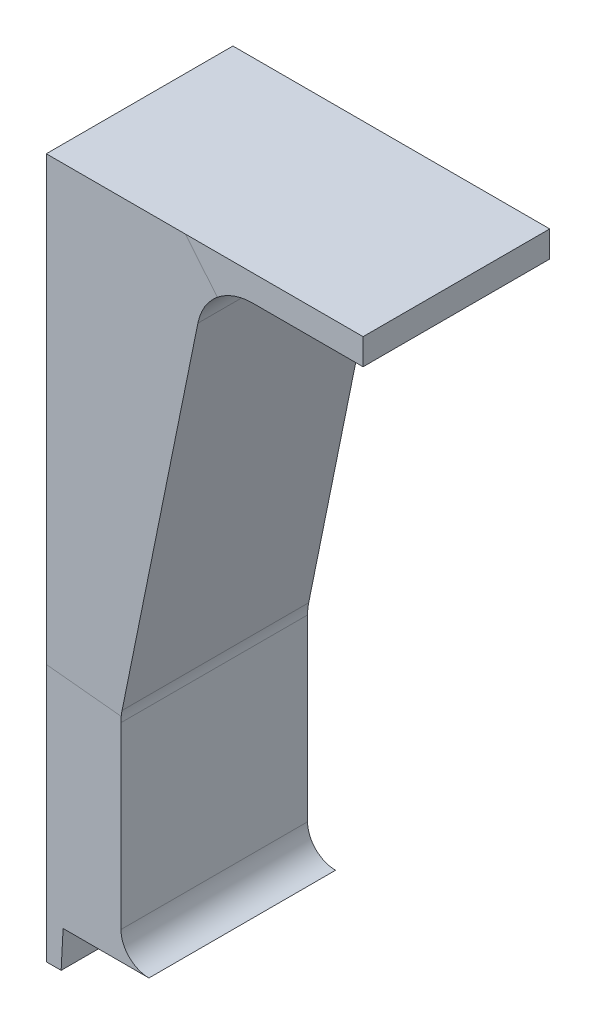
ISO-10303-21;
HEADER;
FILE_DESCRIPTION(('STEP AP214'),'2;1');
FILE_NAME('part.step','',(''),(''),'','','');
FILE_SCHEMA(('AUTOMOTIVE_DESIGN { 1 0 10303 214 1 1 1 1 }'));
ENDSEC;
DATA;
#1=APPLICATION_CONTEXT('core data for automotive mechanical design processes');
#2=APPLICATION_PROTOCOL_DEFINITION('international standard','automotive_design',2000,#1);
#3=PRODUCT_CONTEXT('',#1,'mechanical');
#4=PRODUCT('Part','Part','',(#3));
#5=PRODUCT_RELATED_PRODUCT_CATEGORY('part','',(#4));
#6=PRODUCT_DEFINITION_FORMATION('','',#4);
#7=PRODUCT_DEFINITION_CONTEXT('part definition',#1,'design');
#8=PRODUCT_DEFINITION('design','',#6,#7);
#9=PRODUCT_DEFINITION_SHAPE('','',#8);
#10=(LENGTH_UNIT() NAMED_UNIT(*) SI_UNIT(.MILLI.,.METRE.));
#11=(NAMED_UNIT(*) PLANE_ANGLE_UNIT() SI_UNIT($,.RADIAN.));
#12=(NAMED_UNIT(*) SI_UNIT($,.STERADIAN.) SOLID_ANGLE_UNIT());
#13=UNCERTAINTY_MEASURE_WITH_UNIT(LENGTH_MEASURE(1.E-05),#10,'distance_accuracy_value','');
#14=(GEOMETRIC_REPRESENTATION_CONTEXT(3) GLOBAL_UNCERTAINTY_ASSIGNED_CONTEXT((#13)) GLOBAL_UNIT_ASSIGNED_CONTEXT((#10,
#11,#12)) REPRESENTATION_CONTEXT('',''));
#15=CARTESIAN_POINT('',(0.,0.,0.));
#16=DIRECTION('',(0.,0.,1.));
#17=DIRECTION('',(1.,0.,0.));
#18=AXIS2_PLACEMENT_3D('',#15,#16,#17);
#19=CARTESIAN_POINT('',(0.,5.,0.));
#20=DIRECTION('',(0.,1.,0.));
#21=DIRECTION('',(0.,0.,1.));
#22=AXIS2_PLACEMENT_3D('',#19,#20,#21);
#23=PLANE('',#22);
#24=DIRECTION('',(1.,0.,0.));
#25=VECTOR('',#24,1.);
#26=CARTESIAN_POINT('',(-41.5,5.,10.));
#27=LINE('',#26,#25);
#28=CARTESIAN_POINT('',(-72.1,5.,10.));
#29=VERTEX_POINT('',#28);
#30=CARTESIAN_POINT('',(-67.5,5.,10.));
#31=VERTEX_POINT('',#30);
#32=EDGE_CURVE('E190',#29,#31,#27,.T.);
#33=ORIENTED_EDGE('',*,*,#32,.F.);
#34=DIRECTION('',(0.,0.,-1.));
#35=VECTOR('',#34,1.);
#36=CARTESIAN_POINT('',(-72.1,5.,0.));
#37=LINE('',#36,#35);
#38=CARTESIAN_POINT('',(-72.1,5.,0.));
#39=VERTEX_POINT('',#38);
#40=EDGE_CURVE('E59',#29,#39,#37,.T.);
#41=ORIENTED_EDGE('',*,*,#40,.T.);
#42=DIRECTION('',(-1.,0.,0.));
#43=VECTOR('',#42,1.);
#44=CARTESIAN_POINT('',(0.,5.,0.));
#45=LINE('',#44,#43);
#46=CARTESIAN_POINT('',(-67.5,5.,0.));
#47=VERTEX_POINT('',#46);
#48=EDGE_CURVE('E187',#47,#39,#45,.T.);
#49=ORIENTED_EDGE('',*,*,#48,.F.);
#50=DIRECTION('',(0.,0.,-1.));
#51=VECTOR('',#50,1.);
#52=CARTESIAN_POINT('',(-67.5,5.,0.));
#53=LINE('',#52,#51);
#54=EDGE_CURVE('E38',#47,#31,#53,.F.);
#55=ORIENTED_EDGE('',*,*,#54,.T.);
#56=EDGE_LOOP('',(#33,#41,#49,#55));
#57=FACE_BOUND('',#56,.T.);
#58=ADVANCED_FACE('F35',(#57),#23,.F.);
#59=CARTESIAN_POINT('',(-56.0250628144668,-29.9,0.));
#60=DIRECTION('',(1.,0.,0.));
#61=DIRECTION('',(0.,0.,1.));
#62=AXIS2_PLACEMENT_3D('',#59,#60,#61);
#63=PLANE('',#62);
#64=DIRECTION('',(0.,0.,-1.));
#65=VECTOR('',#64,1.);
#66=CARTESIAN_POINT('',(-56.0250628144669,40.5,0.));
#67=LINE('',#66,#65);
#68=CARTESIAN_POINT('',(-56.0250628144669,40.5,10.));
#69=VERTEX_POINT('',#68);
#70=CARTESIAN_POINT('',(-56.0250628144669,40.5,0.));
#71=VERTEX_POINT('',#70);
#72=EDGE_CURVE('E150',#69,#71,#67,.T.);
#73=ORIENTED_EDGE('',*,*,#72,.F.);
#74=DIRECTION('',(0.,-1.,0.));
#75=VECTOR('',#74,1.);
#76=CARTESIAN_POINT('',(-56.0250628144669,43.0999999999999,10.));
#77=LINE('',#76,#75);
#78=CARTESIAN_POINT('',(-56.0250628144669,39.0999999999999,10.));
#79=VERTEX_POINT('',#78);
#80=EDGE_CURVE('E244',#69,#79,#77,.T.);
#81=ORIENTED_EDGE('',*,*,#80,.T.);
#82=DIRECTION('',(0.,0.,-1.));
#83=VECTOR('',#82,1.);
#84=CARTESIAN_POINT('',(-56.0250628144669,39.0999999999999,0.));
#85=LINE('',#84,#83);
#86=CARTESIAN_POINT('',(-56.0250628144669,39.0999999999999,0.));
#87=VERTEX_POINT('',#86);
#88=EDGE_CURVE('E43',#79,#87,#85,.T.);
#89=ORIENTED_EDGE('',*,*,#88,.T.);
#90=DIRECTION('',(0.,1.,0.));
#91=VECTOR('',#90,1.);
#92=CARTESIAN_POINT('',(-56.0250628144669,43.0999999999999,0.));
#93=LINE('',#92,#91);
#94=EDGE_CURVE('E12',#87,#71,#93,.T.);
#95=ORIENTED_EDGE('',*,*,#94,.T.);
#96=EDGE_LOOP('',(#73,#81,#89,#95));
#97=FACE_BOUND('',#96,.T.);
#98=ADVANCED_FACE('F249',(#97),#63,.T.);
#99=CARTESIAN_POINT('',(-67.9232317202557,39.0999999999999,0.));
#100=DIRECTION('',(0.,-1.,0.));
#101=DIRECTION('',(1.,0.,0.));
#102=AXIS2_PLACEMENT_3D('',#99,#100,#101);
#103=PLANE('',#102);
#104=DIRECTION('',(1.,0.,0.));
#105=VECTOR('',#104,1.);
#106=CARTESIAN_POINT('',(-67.9232317202557,39.0999999999999,10.));
#107=LINE('',#106,#105);
#108=CARTESIAN_POINT('',(-61.9383153013104,39.0999999999999,10.));
#109=VERTEX_POINT('',#108);
#110=EDGE_CURVE('E239',#109,#79,#107,.T.);
#111=ORIENTED_EDGE('',*,*,#110,.F.);
#112=DIRECTION('',(0.,0.,1.));
#113=VECTOR('',#112,1.);
#114=CARTESIAN_POINT('',(-61.9383153013104,39.0999999999999,0.));
#115=LINE('',#114,#113);
#116=CARTESIAN_POINT('',(-61.9383153013104,39.0999999999999,0.));
#117=VERTEX_POINT('',#116);
#118=EDGE_CURVE('E231',#109,#117,#115,.F.);
#119=ORIENTED_EDGE('',*,*,#118,.T.);
#120=DIRECTION('',(1.,0.,0.));
#121=VECTOR('',#120,1.);
#122=CARTESIAN_POINT('',(-67.9232317202557,39.0999999999999,0.));
#123=LINE('',#122,#121);
#124=EDGE_CURVE('E242',#117,#87,#123,.T.);
#125=ORIENTED_EDGE('',*,*,#124,.T.);
#126=ORIENTED_EDGE('',*,*,#88,.F.);
#127=EDGE_LOOP('',(#111,#119,#125,#126));
#128=FACE_BOUND('',#127,.T.);
#129=ADVANCED_FACE('F316',(#128),#103,.T.);
#130=CARTESIAN_POINT('',(-67.9232317202557,43.0999999999999,0.));
#131=DIRECTION('',(0.,0.,-1.));
#132=DIRECTION('',(-1.,0.,0.));
#133=AXIS2_PLACEMENT_3D('',#130,#131,#132);
#134=PLANE('',#133);
#135=DIRECTION('',(1.,0.,0.));
#136=VECTOR('',#135,1.);
#137=CARTESIAN_POINT('',(-73.,40.5,0.));
#138=LINE('',#137,#136);
#139=CARTESIAN_POINT('',(-65.5346531128881,40.5,0.));
#140=VERTEX_POINT('',#139);
#141=EDGE_CURVE('E147',#140,#71,#138,.T.);
#142=ORIENTED_EDGE('',*,*,#141,.T.);
#143=ORIENTED_EDGE('',*,*,#94,.F.);
#144=ORIENTED_EDGE('',*,*,#124,.F.);
#145=CARTESIAN_POINT('',(-61.9383153013104,36.0999999999999,0.));
#146=DIRECTION('',(0.,0.,-1.));
#147=DIRECTION('',(-1.,0.,0.));
#148=AXIS2_PLACEMENT_3D('',#145,#146,#147);
#149=CIRCLE('',#148,3.);
#150=CARTESIAN_POINT('',(-63.8368703588749,38.4228191262765,0.));
#151=VERTEX_POINT('',#150);
#152=EDGE_CURVE('E167',#117,#151,#149,.F.);
#153=ORIENTED_EDGE('',*,*,#152,.T.);
#154=DIRECTION('',(0.63285168585486,-0.774273042092169,0.));
#155=VECTOR('',#154,1.);
#156=CARTESIAN_POINT('',(-56.863927121926,29.8916544109364,0.));
#157=LINE('',#156,#155);
#158=EDGE_CURVE('E159',#140,#151,#157,.T.);
#159=ORIENTED_EDGE('',*,*,#158,.F.);
#160=EDGE_LOOP('',(#142,#143,#144,#153,#159));
#161=FACE_BOUND('',#160,.T.);
#162=ADVANCED_FACE('F164',(#161),#134,.T.);
#163=CARTESIAN_POINT('',(-67.9232317202557,43.0999999999999,10.));
#164=DIRECTION('',(0.,0.,1.));
#165=DIRECTION('',(1.,0.,0.));
#166=AXIS2_PLACEMENT_3D('',#163,#164,#165);
#167=PLANE('',#166);
#168=DIRECTION('',(1.,0.,0.));
#169=VECTOR('',#168,1.);
#170=CARTESIAN_POINT('',(-67.9232317202557,40.5,10.));
#171=LINE('',#170,#169);
#172=CARTESIAN_POINT('',(-65.5346531128881,40.5,10.));
#173=VERTEX_POINT('',#172);
#174=EDGE_CURVE('E306',#173,#69,#171,.T.);
#175=ORIENTED_EDGE('',*,*,#174,.F.);
#176=DIRECTION('',(-0.63285168585486,0.774273042092169,0.));
#177=VECTOR('',#176,1.);
#178=CARTESIAN_POINT('',(-56.863927121926,29.8916544109364,10.));
#179=LINE('',#178,#177);
#180=CARTESIAN_POINT('',(-63.8368703588749,38.4228191262765,10.));
#181=VERTEX_POINT('',#180);
#182=EDGE_CURVE('E170',#181,#173,#179,.T.);
#183=ORIENTED_EDGE('',*,*,#182,.F.);
#184=CARTESIAN_POINT('',(-61.9383153013104,36.0999999999999,10.));
#185=DIRECTION('',(0.,0.,1.));
#186=DIRECTION('',(1.,0.,0.));
#187=AXIS2_PLACEMENT_3D('',#184,#185,#186);
#188=CIRCLE('',#187,3.);
#189=EDGE_CURVE('E226',#181,#109,#188,.F.);
#190=ORIENTED_EDGE('',*,*,#189,.T.);
#191=ORIENTED_EDGE('',*,*,#110,.T.);
#192=ORIENTED_EDGE('',*,*,#80,.F.);
#193=EDGE_LOOP('',(#175,#183,#190,#191,#192));
#194=FACE_BOUND('',#193,.T.);
#195=ADVANCED_FACE('F315',(#194),#167,.T.);
#196=CARTESIAN_POINT('',(-61.9383153013104,36.0999999999999,0.));
#197=DIRECTION('',(0.,0.,-1.));
#198=DIRECTION('',(0.,1.,0.));
#199=AXIS2_PLACEMENT_3D('',#196,#197,#198);
#200=CYLINDRICAL_SURFACE('',#199,3.);
#201=ORIENTED_EDGE('',*,*,#152,.F.);
#202=ORIENTED_EDGE('',*,*,#118,.F.);
#203=ORIENTED_EDGE('',*,*,#189,.F.);
#204=CARTESIAN_POINT('',(-61.9383153013104,36.0999999999999,10.));
#205=DIRECTION('',(0.,0.,1.));
#206=DIRECTION('',(1.,0.,0.));
#207=AXIS2_PLACEMENT_3D('',#204,#205,#206);
#208=CIRCLE('',#207,3.);
#209=CARTESIAN_POINT('',(-64.8783153013104,36.6969924622639,10.));
#210=VERTEX_POINT('',#209);
#211=EDGE_CURVE('E228',#210,#181,#208,.F.);
#212=ORIENTED_EDGE('',*,*,#211,.F.);
#213=DIRECTION('',(0.,0.,1.));
#214=VECTOR('',#213,1.);
#215=CARTESIAN_POINT('',(-64.8783153013104,36.6969924622639,10.));
#216=LINE('',#215,#214);
#217=CARTESIAN_POINT('',(-64.8783153013104,36.6969924622639,0.));
#218=VERTEX_POINT('',#217);
#219=EDGE_CURVE('E233',#218,#210,#216,.T.);
#220=ORIENTED_EDGE('',*,*,#219,.F.);
#221=CARTESIAN_POINT('',(-61.9383153013104,36.0999999999999,0.));
#222=DIRECTION('',(0.,0.,-1.));
#223=DIRECTION('',(-1.,0.,0.));
#224=AXIS2_PLACEMENT_3D('',#221,#222,#223);
#225=CIRCLE('',#224,3.);
#226=EDGE_CURVE('E223',#151,#218,#225,.F.);
#227=ORIENTED_EDGE('',*,*,#226,.F.);
#228=EDGE_LOOP('',(#201,#202,#203,#212,#220,#227));
#229=FACE_BOUND('',#228,.T.);
#230=ADVANCED_FACE('F255',(#229),#200,.F.);
#231=CARTESIAN_POINT('',(-69.1038997487421,15.8873188721875,0.));
#232=DIRECTION('',(0.98,-0.198997487421325,0.));
#233=DIRECTION('',(0.198997487421325,0.98,0.));
#234=AXIS2_PLACEMENT_3D('',#231,#232,#233);
#235=PLANE('',#234);
#236=DIRECTION('',(0.198997487421325,0.98,0.));
#237=VECTOR('',#236,1.);
#238=CARTESIAN_POINT('',(-69.1038997487421,15.8873188721875,10.));
#239=LINE('',#238,#237);
#240=CARTESIAN_POINT('',(-68.94,16.6944735546344,10.));
#241=VERTEX_POINT('',#240);
#242=EDGE_CURVE('E169',#241,#210,#239,.T.);
#243=ORIENTED_EDGE('',*,*,#242,.F.);
#244=DIRECTION('',(0.,0.,1.));
#245=VECTOR('',#244,1.);
#246=CARTESIAN_POINT('',(-68.94,16.6944735546344,0.));
#247=LINE('',#246,#245);
#248=CARTESIAN_POINT('',(-68.94,16.6944735546344,0.));
#249=VERTEX_POINT('',#248);
#250=EDGE_CURVE('E218',#241,#249,#247,.F.);
#251=ORIENTED_EDGE('',*,*,#250,.T.);
#252=DIRECTION('',(0.198997487421325,0.98,0.));
#253=VECTOR('',#252,1.);
#254=CARTESIAN_POINT('',(-69.1038997487421,15.8873188721875,0.));
#255=LINE('',#254,#253);
#256=EDGE_CURVE('E172',#249,#218,#255,.T.);
#257=ORIENTED_EDGE('',*,*,#256,.T.);
#258=ORIENTED_EDGE('',*,*,#219,.T.);
#259=EDGE_LOOP('',(#243,#251,#257,#258));
#260=FACE_BOUND('',#259,.T.);
#261=ADVANCED_FACE('F347',(#260),#235,.T.);
#262=CARTESIAN_POINT('',(-73.0238997487421,16.6833088218728,0.));
#263=DIRECTION('',(0.,0.,-1.));
#264=DIRECTION('',(-1.,0.,0.));
#265=AXIS2_PLACEMENT_3D('',#262,#263,#264);
#266=PLANE('',#265);
#267=CARTESIAN_POINT('',(-73.,40.5,0.));
#268=VERTEX_POINT('',#267);
#269=EDGE_CURVE('E51',#268,#140,#138,.T.);
#270=ORIENTED_EDGE('',*,*,#269,.T.);
#271=ORIENTED_EDGE('',*,*,#158,.T.);
#272=ORIENTED_EDGE('',*,*,#226,.T.);
#273=ORIENTED_EDGE('',*,*,#256,.F.);
#274=CARTESIAN_POINT('',(-66.,16.0974810923704,0.));
#275=DIRECTION('',(0.,0.,-1.));
#276=DIRECTION('',(-1.,0.,0.));
#277=AXIS2_PLACEMENT_3D('',#274,#275,#276);
#278=CIRCLE('',#277,3.);
#279=CARTESIAN_POINT('',(-68.9849623113198,16.3974810923704,0.));
#280=VERTEX_POINT('',#279);
#281=EDGE_CURVE('E210',#249,#280,#278,.F.);
#282=ORIENTED_EDGE('',*,*,#281,.T.);
#283=DIRECTION('',(0.99498743710662,-0.1,0.));
#284=VECTOR('',#283,1.);
#285=CARTESIAN_POINT('',(-71.8258145729563,16.6829974874213,0.));
#286=LINE('',#285,#284);
#287=CARTESIAN_POINT('',(-73.,16.8010075630518,0.));
#288=VERTEX_POINT('',#287);
#289=EDGE_CURVE('E181',#288,#280,#286,.T.);
#290=ORIENTED_EDGE('',*,*,#289,.F.);
#291=DIRECTION('',(0.,1.,0.));
#292=VECTOR('',#291,1.);
#293=CARTESIAN_POINT('',(-73.,43.1,0.));
#294=LINE('',#293,#292);
#295=EDGE_CURVE('E162',#288,#268,#294,.T.);
#296=ORIENTED_EDGE('',*,*,#295,.T.);
#297=EDGE_LOOP('',(#270,#271,#272,#273,#282,#290,#296));
#298=FACE_BOUND('',#297,.T.);
#299=ADVANCED_FACE('F157',(#298),#266,.T.);
#300=CARTESIAN_POINT('',(-73.0238997487421,16.6833088218728,10.));
#301=DIRECTION('',(0.,0.,1.));
#302=DIRECTION('',(1.,0.,0.));
#303=AXIS2_PLACEMENT_3D('',#300,#301,#302);
#304=PLANE('',#303);
#305=DIRECTION('',(1.,0.,0.));
#306=VECTOR('',#305,1.);
#307=CARTESIAN_POINT('',(-73.0238997487421,40.5,10.));
#308=LINE('',#307,#306);
#309=CARTESIAN_POINT('',(-73.,40.5,10.));
#310=VERTEX_POINT('',#309);
#311=EDGE_CURVE('E310',#310,#173,#308,.T.);
#312=ORIENTED_EDGE('',*,*,#311,.F.);
#313=DIRECTION('',(0.,1.,0.));
#314=VECTOR('',#313,1.);
#315=CARTESIAN_POINT('',(-73.,43.1,10.));
#316=LINE('',#315,#314);
#317=CARTESIAN_POINT('',(-73.,16.8010075630518,10.));
#318=VERTEX_POINT('',#317);
#319=EDGE_CURVE('E292',#318,#310,#316,.T.);
#320=ORIENTED_EDGE('',*,*,#319,.F.);
#321=DIRECTION('',(-0.99498743710662,0.1,0.));
#322=VECTOR('',#321,1.);
#323=CARTESIAN_POINT('',(-71.8258145729563,16.6829974874213,10.));
#324=LINE('',#323,#322);
#325=CARTESIAN_POINT('',(-68.9849623113198,16.3974810923704,10.));
#326=VERTEX_POINT('',#325);
#327=EDGE_CURVE('E184',#326,#318,#324,.T.);
#328=ORIENTED_EDGE('',*,*,#327,.F.);
#329=CARTESIAN_POINT('',(-66.,16.0974810923704,10.));
#330=DIRECTION('',(0.,0.,1.));
#331=DIRECTION('',(1.,0.,0.));
#332=AXIS2_PLACEMENT_3D('',#329,#330,#331);
#333=CIRCLE('',#332,3.);
#334=EDGE_CURVE('E213',#326,#241,#333,.F.);
#335=ORIENTED_EDGE('',*,*,#334,.T.);
#336=ORIENTED_EDGE('',*,*,#242,.T.);
#337=ORIENTED_EDGE('',*,*,#211,.T.);
#338=ORIENTED_EDGE('',*,*,#182,.T.);
#339=EDGE_LOOP('',(#312,#320,#328,#335,#336,#337,#338));
#340=FACE_BOUND('',#339,.T.);
#341=ADVANCED_FACE('F313',(#340),#304,.T.);
#342=CARTESIAN_POINT('',(-66.,16.0974810923704,0.));
#343=DIRECTION('',(0.,0.,-1.));
#344=DIRECTION('',(-1.,0.,0.));
#345=AXIS2_PLACEMENT_3D('',#342,#343,#344);
#346=CYLINDRICAL_SURFACE('',#345,3.);
#347=ORIENTED_EDGE('',*,*,#281,.F.);
#348=ORIENTED_EDGE('',*,*,#250,.F.);
#349=ORIENTED_EDGE('',*,*,#334,.F.);
#350=CARTESIAN_POINT('',(-66.,16.0974810923704,10.));
#351=DIRECTION('',(0.,0.,-1.));
#352=DIRECTION('',(-1.,0.,0.));
#353=AXIS2_PLACEMENT_3D('',#350,#351,#352);
#354=CIRCLE('',#353,3.);
#355=CARTESIAN_POINT('',(-69.,16.0974810923704,10.));
#356=VERTEX_POINT('',#355);
#357=EDGE_CURVE('E215',#356,#326,#354,.T.);
#358=ORIENTED_EDGE('',*,*,#357,.F.);
#359=DIRECTION('',(0.,0.,1.));
#360=VECTOR('',#359,1.);
#361=CARTESIAN_POINT('',(-69.,16.0974810923704,10.));
#362=LINE('',#361,#360);
#363=CARTESIAN_POINT('',(-69.,16.0974810923704,0.));
#364=VERTEX_POINT('',#363);
#365=EDGE_CURVE('E220',#364,#356,#362,.T.);
#366=ORIENTED_EDGE('',*,*,#365,.F.);
#367=CARTESIAN_POINT('',(-66.,16.0974810923704,0.));
#368=DIRECTION('',(0.,0.,1.));
#369=DIRECTION('',(1.,0.,0.));
#370=AXIS2_PLACEMENT_3D('',#367,#368,#369);
#371=CIRCLE('',#370,3.);
#372=EDGE_CURVE('E207',#280,#364,#371,.T.);
#373=ORIENTED_EDGE('',*,*,#372,.F.);
#374=EDGE_LOOP('',(#347,#348,#349,#358,#366,#373));
#375=FACE_BOUND('',#374,.T.);
#376=ADVANCED_FACE('F265',(#375),#346,.F.);
#377=CARTESIAN_POINT('',(-73.,5.,0.));
#378=DIRECTION('',(1.,0.,0.));
#379=DIRECTION('',(0.,0.,-1.));
#380=AXIS2_PLACEMENT_3D('',#377,#378,#379);
#381=PLANE('',#380);
#382=ORIENTED_EDGE('',*,*,#319,.T.);
#383=DIRECTION('',(0.,0.,1.));
#384=VECTOR('',#383,1.);
#385=CARTESIAN_POINT('',(-73.,40.5,0.));
#386=LINE('',#385,#384);
#387=EDGE_CURVE('E163',#268,#310,#386,.T.);
#388=ORIENTED_EDGE('',*,*,#387,.F.);
#389=ORIENTED_EDGE('',*,*,#295,.F.);
#390=DIRECTION('',(0.,-1.,0.));
#391=VECTOR('',#390,1.);
#392=CARTESIAN_POINT('',(-73.,5.,0.));
#393=LINE('',#392,#391);
#394=CARTESIAN_POINT('',(-73.,3.,0.));
#395=VERTEX_POINT('',#394);
#396=EDGE_CURVE('E236',#288,#395,#393,.T.);
#397=ORIENTED_EDGE('',*,*,#396,.T.);
#398=DIRECTION('',(0.,0.,1.));
#399=VECTOR('',#398,1.);
#400=CARTESIAN_POINT('',(-73.,3.,0.));
#401=LINE('',#400,#399);
#402=CARTESIAN_POINT('',(-73.,3.,10.));
#403=VERTEX_POINT('',#402);
#404=EDGE_CURVE('E282',#395,#403,#401,.T.);
#405=ORIENTED_EDGE('',*,*,#404,.T.);
#406=DIRECTION('',(0.,-1.,0.));
#407=VECTOR('',#406,1.);
#408=CARTESIAN_POINT('',(-73.,5.,10.));
#409=LINE('',#408,#407);
#410=EDGE_CURVE('E186',#318,#403,#409,.T.);
#411=ORIENTED_EDGE('',*,*,#410,.F.);
#412=EDGE_LOOP('',(#382,#388,#389,#397,#405,#411));
#413=FACE_BOUND('',#412,.T.);
#414=ADVANCED_FACE('F280',(#413),#381,.F.);
#415=CARTESIAN_POINT('',(-69.,5.,0.));
#416=DIRECTION('',(1.,0.,0.));
#417=DIRECTION('',(0.,0.,-1.));
#418=AXIS2_PLACEMENT_3D('',#415,#416,#417);
#419=PLANE('',#418);
#420=DIRECTION('',(0.,1.,0.));
#421=VECTOR('',#420,1.);
#422=CARTESIAN_POINT('',(-69.,5.,10.));
#423=LINE('',#422,#421);
#424=CARTESIAN_POINT('',(-69.,6.5,10.));
#425=VERTEX_POINT('',#424);
#426=EDGE_CURVE('E175',#425,#356,#423,.T.);
#427=ORIENTED_EDGE('',*,*,#426,.F.);
#428=DIRECTION('',(0.,0.,-1.));
#429=VECTOR('',#428,1.);
#430=CARTESIAN_POINT('',(-69.,6.5,0.));
#431=LINE('',#430,#429);
#432=CARTESIAN_POINT('',(-69.,6.5,0.));
#433=VERTEX_POINT('',#432);
#434=EDGE_CURVE('E204',#425,#433,#431,.T.);
#435=ORIENTED_EDGE('',*,*,#434,.T.);
#436=DIRECTION('',(0.,1.,0.));
#437=VECTOR('',#436,1.);
#438=CARTESIAN_POINT('',(-69.,5.,0.));
#439=LINE('',#438,#437);
#440=EDGE_CURVE('E179',#433,#364,#439,.T.);
#441=ORIENTED_EDGE('',*,*,#440,.T.);
#442=ORIENTED_EDGE('',*,*,#365,.T.);
#443=EDGE_LOOP('',(#427,#435,#441,#442));
#444=FACE_BOUND('',#443,.T.);
#445=ADVANCED_FACE('F350',(#444),#419,.T.);
#446=CARTESIAN_POINT('',(0.,5.,0.));
#447=DIRECTION('',(0.,0.,1.));
#448=DIRECTION('',(1.,0.,0.));
#449=AXIS2_PLACEMENT_3D('',#446,#447,#448);
#450=PLANE('',#449);
#451=CARTESIAN_POINT('',(-67.5,6.5,0.));
#452=DIRECTION('',(0.,0.,1.));
#453=DIRECTION('',(1.,0.,0.));
#454=AXIS2_PLACEMENT_3D('',#451,#452,#453);
#455=CIRCLE('',#454,1.5);
#456=EDGE_CURVE('E201',#433,#47,#455,.T.);
#457=ORIENTED_EDGE('',*,*,#456,.T.);
#458=ORIENTED_EDGE('',*,*,#48,.T.);
#459=DIRECTION('',(0.0523359562429438,0.998629534754574,0.));
#460=VECTOR('',#459,1.);
#461=CARTESIAN_POINT('',(-72.1,5.,0.));
#462=LINE('',#461,#460);
#463=CARTESIAN_POINT('',(-72.2048155585661,3.,0.));
#464=VERTEX_POINT('',#463);
#465=EDGE_CURVE('E299',#464,#39,#462,.T.);
#466=ORIENTED_EDGE('',*,*,#465,.F.);
#467=DIRECTION('',(-1.,0.,0.));
#468=VECTOR('',#467,1.);
#469=CARTESIAN_POINT('',(0.,3.,0.));
#470=LINE('',#469,#468);
#471=EDGE_CURVE('E275',#464,#395,#470,.T.);
#472=ORIENTED_EDGE('',*,*,#471,.T.);
#473=ORIENTED_EDGE('',*,*,#396,.F.);
#474=ORIENTED_EDGE('',*,*,#289,.T.);
#475=ORIENTED_EDGE('',*,*,#372,.T.);
#476=ORIENTED_EDGE('',*,*,#440,.F.);
#477=EDGE_LOOP('',(#457,#458,#466,#472,#473,#474,#475,#476));
#478=FACE_BOUND('',#477,.T.);
#479=ADVANCED_FACE('F271',(#478),#450,.F.);
#480=CARTESIAN_POINT('',(-41.5,5.,10.));
#481=DIRECTION('',(0.,0.,-1.));
#482=DIRECTION('',(-1.,0.,0.));
#483=AXIS2_PLACEMENT_3D('',#480,#481,#482);
#484=PLANE('',#483);
#485=ORIENTED_EDGE('',*,*,#410,.T.);
#486=DIRECTION('',(1.,0.,0.));
#487=VECTOR('',#486,1.);
#488=CARTESIAN_POINT('',(-41.5,3.,10.));
#489=LINE('',#488,#487);
#490=CARTESIAN_POINT('',(-72.2048155585661,3.,10.));
#491=VERTEX_POINT('',#490);
#492=EDGE_CURVE('E289',#403,#491,#489,.T.);
#493=ORIENTED_EDGE('',*,*,#492,.T.);
#494=DIRECTION('',(0.0523359562429438,0.998629534754574,0.));
#495=VECTOR('',#494,1.);
#496=CARTESIAN_POINT('',(-72.1207134624022,4.60476359262682,10.));
#497=LINE('',#496,#495);
#498=EDGE_CURVE('E198',#491,#29,#497,.T.);
#499=ORIENTED_EDGE('',*,*,#498,.T.);
#500=ORIENTED_EDGE('',*,*,#32,.T.);
#501=CARTESIAN_POINT('',(-67.5,6.5,10.));
#502=DIRECTION('',(0.,0.,-1.));
#503=DIRECTION('',(-1.,0.,0.));
#504=AXIS2_PLACEMENT_3D('',#501,#502,#503);
#505=CIRCLE('',#504,1.5);
#506=EDGE_CURVE('E197',#31,#425,#505,.T.);
#507=ORIENTED_EDGE('',*,*,#506,.T.);
#508=ORIENTED_EDGE('',*,*,#426,.T.);
#509=ORIENTED_EDGE('',*,*,#357,.T.);
#510=ORIENTED_EDGE('',*,*,#327,.T.);
#511=EDGE_LOOP('',(#485,#493,#499,#500,#507,#508,#509,#510));
#512=FACE_BOUND('',#511,.T.);
#513=ADVANCED_FACE('F303',(#512),#484,.F.);
#514=CARTESIAN_POINT('',(-67.5,6.5,0.));
#515=DIRECTION('',(0.,0.,-1.));
#516=DIRECTION('',(-1.,0.,0.));
#517=AXIS2_PLACEMENT_3D('',#514,#515,#516);
#518=CYLINDRICAL_SURFACE('',#517,1.5);
#519=ORIENTED_EDGE('',*,*,#506,.F.);
#520=ORIENTED_EDGE('',*,*,#54,.F.);
#521=ORIENTED_EDGE('',*,*,#456,.F.);
#522=ORIENTED_EDGE('',*,*,#434,.F.);
#523=EDGE_LOOP('',(#519,#520,#521,#522));
#524=FACE_BOUND('',#523,.T.);
#525=ADVANCED_FACE('F328',(#524),#518,.F.);
#526=CARTESIAN_POINT('',(-72.1,5.,0.));
#527=DIRECTION('',(0.998629534754574,-0.0523359562429438,0.));
#528=DIRECTION('',(0.0523359562429438,0.998629534754574,0.));
#529=AXIS2_PLACEMENT_3D('',#526,#527,#528);
#530=PLANE('',#529);
#531=ORIENTED_EDGE('',*,*,#40,.F.);
#532=ORIENTED_EDGE('',*,*,#498,.F.);
#533=DIRECTION('',(0.,0.,-1.));
#534=VECTOR('',#533,1.);
#535=CARTESIAN_POINT('',(-72.2048155585661,3.,0.));
#536=LINE('',#535,#534);
#537=EDGE_CURVE('E297',#491,#464,#536,.T.);
#538=ORIENTED_EDGE('',*,*,#537,.T.);
#539=ORIENTED_EDGE('',*,*,#465,.T.);
#540=EDGE_LOOP('',(#531,#532,#538,#539));
#541=FACE_BOUND('',#540,.T.);
#542=ADVANCED_FACE('F300',(#541),#530,.T.);
#543=CARTESIAN_POINT('',(0.,3.,0.));
#544=DIRECTION('',(0.,1.,0.));
#545=DIRECTION('',(0.,0.,1.));
#546=AXIS2_PLACEMENT_3D('',#543,#544,#545);
#547=PLANE('',#546);
#548=ORIENTED_EDGE('',*,*,#537,.F.);
#549=ORIENTED_EDGE('',*,*,#492,.F.);
#550=ORIENTED_EDGE('',*,*,#404,.F.);
#551=ORIENTED_EDGE('',*,*,#471,.F.);
#552=EDGE_LOOP('',(#548,#549,#550,#551));
#553=FACE_BOUND('',#552,.T.);
#554=ADVANCED_FACE('F286',(#553),#547,.F.);
#555=CARTESIAN_POINT('',(-73.,40.5,0.));
#556=DIRECTION('',(0.,-1.,0.));
#557=DIRECTION('',(0.,0.,-1.));
#558=AXIS2_PLACEMENT_3D('',#555,#556,#557);
#559=PLANE('',#558);
#560=ORIENTED_EDGE('',*,*,#72,.T.);
#561=ORIENTED_EDGE('',*,*,#141,.F.);
#562=ORIENTED_EDGE('',*,*,#269,.F.);
#563=ORIENTED_EDGE('',*,*,#387,.T.);
#564=ORIENTED_EDGE('',*,*,#311,.T.);
#565=ORIENTED_EDGE('',*,*,#174,.T.);
#566=EDGE_LOOP('',(#560,#561,#562,#563,#564,#565));
#567=FACE_BOUND('',#566,.T.);
#568=ADVANCED_FACE('F148',(#567),#559,.F.);
#569=CLOSED_SHELL('',(#58,#98,#129,#162,#195,#230,#261,#299,#341,#376,#414,#445,#479,#513,#525,
#542,#554,#568));
#570=MANIFOLD_SOLID_BREP('B2',#569);
#571=ADVANCED_BREP_SHAPE_REPRESENTATION('',(#18,#570),#14);
#572=SHAPE_DEFINITION_REPRESENTATION(#9,#571);
ENDSEC;
END-ISO-10303-21;
